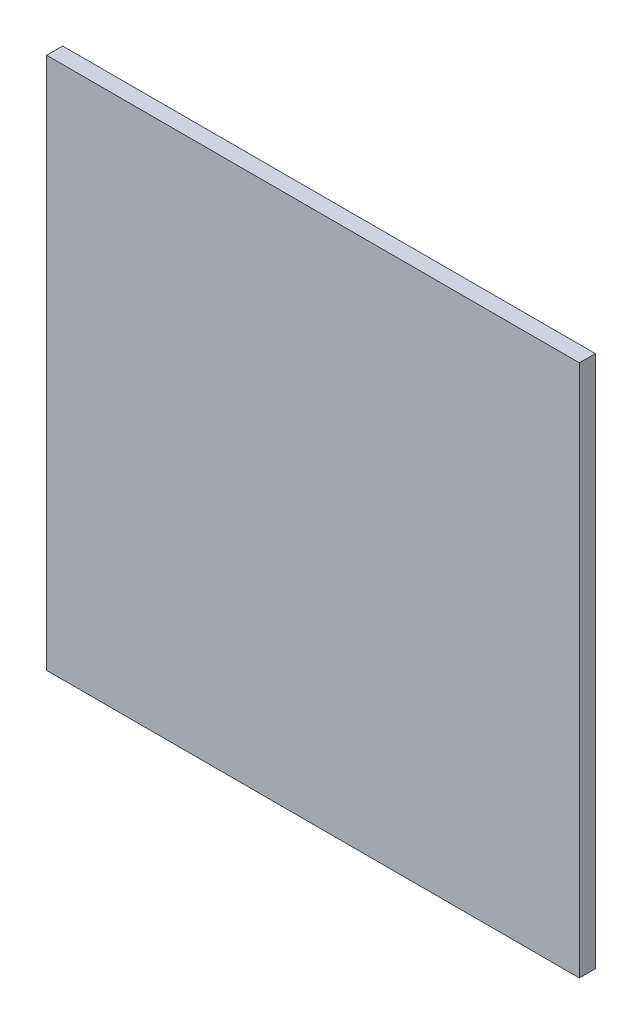
ISO-10303-21;
HEADER;
FILE_DESCRIPTION(('STEP AP214'),'2;1');
FILE_NAME('part.step','',(''),(''),'','','');
FILE_SCHEMA(('AUTOMOTIVE_DESIGN { 1 0 10303 214 1 1 1 1 }'));
ENDSEC;
DATA;
#1=APPLICATION_CONTEXT('core data for automotive mechanical design processes');
#2=APPLICATION_PROTOCOL_DEFINITION('international standard','automotive_design',2000,#1);
#3=PRODUCT_CONTEXT('',#1,'mechanical');
#4=PRODUCT('Part','Part','',(#3));
#5=PRODUCT_RELATED_PRODUCT_CATEGORY('part','',(#4));
#6=PRODUCT_DEFINITION_FORMATION('','',#4);
#7=PRODUCT_DEFINITION_CONTEXT('part definition',#1,'design');
#8=PRODUCT_DEFINITION('design','',#6,#7);
#9=PRODUCT_DEFINITION_SHAPE('','',#8);
#10=(LENGTH_UNIT() NAMED_UNIT(*) SI_UNIT(.MILLI.,.METRE.));
#11=(NAMED_UNIT(*) PLANE_ANGLE_UNIT() SI_UNIT($,.RADIAN.));
#12=(NAMED_UNIT(*) SI_UNIT($,.STERADIAN.) SOLID_ANGLE_UNIT());
#13=UNCERTAINTY_MEASURE_WITH_UNIT(LENGTH_MEASURE(1.E-05),#10,'distance_accuracy_value','');
#14=(GEOMETRIC_REPRESENTATION_CONTEXT(3) GLOBAL_UNCERTAINTY_ASSIGNED_CONTEXT((#13)) GLOBAL_UNIT_ASSIGNED_CONTEXT((#10,
#11,#12)) REPRESENTATION_CONTEXT('',''));
#15=CARTESIAN_POINT('',(0.,0.,0.));
#16=DIRECTION('',(0.,0.,1.));
#17=DIRECTION('',(1.,0.,0.));
#18=AXIS2_PLACEMENT_3D('',#15,#16,#17);
#19=CARTESIAN_POINT('',(0.,0.,3.));
#20=DIRECTION('',(1.,0.,0.));
#21=DIRECTION('',(0.,0.,-1.));
#22=AXIS2_PLACEMENT_3D('',#19,#20,#21);
#23=PLANE('',#22);
#24=DIRECTION('',(0.,-1.,0.));
#25=VECTOR('',#24,1.);
#26=CARTESIAN_POINT('',(0.,0.,0.));
#27=LINE('',#26,#25);
#28=CARTESIAN_POINT('',(0.,100.,0.));
#29=VERTEX_POINT('',#28);
#30=CARTESIAN_POINT('',(0.,0.,0.));
#31=VERTEX_POINT('',#30);
#32=EDGE_CURVE('E107',#29,#31,#27,.T.);
#33=ORIENTED_EDGE('',*,*,#32,.T.);
#34=DIRECTION('',(0.,0.,-1.));
#35=VECTOR('',#34,1.);
#36=CARTESIAN_POINT('',(0.,0.,3.));
#37=LINE('',#36,#35);
#38=CARTESIAN_POINT('',(0.,0.,3.));
#39=VERTEX_POINT('',#38);
#40=EDGE_CURVE('E11',#39,#31,#37,.T.);
#41=ORIENTED_EDGE('',*,*,#40,.F.);
#42=DIRECTION('',(0.,-1.,0.));
#43=VECTOR('',#42,1.);
#44=CARTESIAN_POINT('',(0.,0.,3.));
#45=LINE('',#44,#43);
#46=CARTESIAN_POINT('',(0.,100.,3.));
#47=VERTEX_POINT('',#46);
#48=EDGE_CURVE('E91',#47,#39,#45,.T.);
#49=ORIENTED_EDGE('',*,*,#48,.F.);
#50=DIRECTION('',(0.,0.,-1.));
#51=VECTOR('',#50,1.);
#52=CARTESIAN_POINT('',(0.,100.,3.));
#53=LINE('',#52,#51);
#54=EDGE_CURVE('E103',#47,#29,#53,.T.);
#55=ORIENTED_EDGE('',*,*,#54,.T.);
#56=EDGE_LOOP('',(#33,#41,#49,#55));
#57=FACE_BOUND('',#56,.T.);
#58=ADVANCED_FACE('F39',(#57),#23,.F.);
#59=CARTESIAN_POINT('',(0.,0.,3.));
#60=DIRECTION('',(0.,1.,0.));
#61=DIRECTION('',(0.,0.,1.));
#62=AXIS2_PLACEMENT_3D('',#59,#60,#61);
#63=PLANE('',#62);
#64=DIRECTION('',(1.,0.,0.));
#65=VECTOR('',#64,1.);
#66=CARTESIAN_POINT('',(0.,0.,0.));
#67=LINE('',#66,#65);
#68=CARTESIAN_POINT('',(100.,0.,0.));
#69=VERTEX_POINT('',#68);
#70=EDGE_CURVE('E96',#31,#69,#67,.T.);
#71=ORIENTED_EDGE('',*,*,#70,.T.);
#72=DIRECTION('',(0.,0.,-1.));
#73=VECTOR('',#72,1.);
#74=CARTESIAN_POINT('',(100.,0.,3.));
#75=LINE('',#74,#73);
#76=CARTESIAN_POINT('',(100.,0.,3.));
#77=VERTEX_POINT('',#76);
#78=EDGE_CURVE('E48',#77,#69,#75,.T.);
#79=ORIENTED_EDGE('',*,*,#78,.F.);
#80=DIRECTION('',(1.,0.,0.));
#81=VECTOR('',#80,1.);
#82=CARTESIAN_POINT('',(0.,0.,3.));
#83=LINE('',#82,#81);
#84=EDGE_CURVE('E86',#39,#77,#83,.T.);
#85=ORIENTED_EDGE('',*,*,#84,.F.);
#86=ORIENTED_EDGE('',*,*,#40,.T.);
#87=EDGE_LOOP('',(#71,#79,#85,#86));
#88=FACE_BOUND('',#87,.T.);
#89=ADVANCED_FACE('F95',(#88),#63,.F.);
#90=CARTESIAN_POINT('',(100.,0.,3.));
#91=DIRECTION('',(-1.,0.,0.));
#92=DIRECTION('',(0.,0.,1.));
#93=AXIS2_PLACEMENT_3D('',#90,#91,#92);
#94=PLANE('',#93);
#95=DIRECTION('',(0.,1.,0.));
#96=VECTOR('',#95,1.);
#97=CARTESIAN_POINT('',(100.,0.,0.));
#98=LINE('',#97,#96);
#99=CARTESIAN_POINT('',(100.,100.,0.));
#100=VERTEX_POINT('',#99);
#101=EDGE_CURVE('E73',#69,#100,#98,.T.);
#102=ORIENTED_EDGE('',*,*,#101,.T.);
#103=DIRECTION('',(0.,0.,-1.));
#104=VECTOR('',#103,1.);
#105=CARTESIAN_POINT('',(100.,100.,3.));
#106=LINE('',#105,#104);
#107=CARTESIAN_POINT('',(100.,100.,3.));
#108=VERTEX_POINT('',#107);
#109=EDGE_CURVE('E98',#108,#100,#106,.T.);
#110=ORIENTED_EDGE('',*,*,#109,.F.);
#111=DIRECTION('',(0.,1.,0.));
#112=VECTOR('',#111,1.);
#113=CARTESIAN_POINT('',(100.,0.,3.));
#114=LINE('',#113,#112);
#115=EDGE_CURVE('E89',#77,#108,#114,.T.);
#116=ORIENTED_EDGE('',*,*,#115,.F.);
#117=ORIENTED_EDGE('',*,*,#78,.T.);
#118=EDGE_LOOP('',(#102,#110,#116,#117));
#119=FACE_BOUND('',#118,.T.);
#120=ADVANCED_FACE('F99',(#119),#94,.F.);
#121=CARTESIAN_POINT('',(0.,100.,3.));
#122=DIRECTION('',(0.,-1.,0.));
#123=DIRECTION('',(0.,0.,-1.));
#124=AXIS2_PLACEMENT_3D('',#121,#122,#123);
#125=PLANE('',#124);
#126=DIRECTION('',(-1.,0.,0.));
#127=VECTOR('',#126,1.);
#128=CARTESIAN_POINT('',(0.,100.,0.));
#129=LINE('',#128,#127);
#130=EDGE_CURVE('E79',#100,#29,#129,.T.);
#131=ORIENTED_EDGE('',*,*,#130,.T.);
#132=ORIENTED_EDGE('',*,*,#54,.F.);
#133=DIRECTION('',(-1.,0.,0.));
#134=VECTOR('',#133,1.);
#135=CARTESIAN_POINT('',(0.,100.,3.));
#136=LINE('',#135,#134);
#137=EDGE_CURVE('E56',#108,#47,#136,.T.);
#138=ORIENTED_EDGE('',*,*,#137,.F.);
#139=ORIENTED_EDGE('',*,*,#109,.T.);
#140=EDGE_LOOP('',(#131,#132,#138,#139));
#141=FACE_BOUND('',#140,.T.);
#142=ADVANCED_FACE('F120',(#141),#125,.F.);
#143=CARTESIAN_POINT('',(0.,0.,3.));
#144=DIRECTION('',(0.,0.,-1.));
#145=DIRECTION('',(-1.,0.,0.));
#146=AXIS2_PLACEMENT_3D('',#143,#144,#145);
#147=PLANE('',#146);
#148=ORIENTED_EDGE('',*,*,#48,.T.);
#149=ORIENTED_EDGE('',*,*,#84,.T.);
#150=ORIENTED_EDGE('',*,*,#115,.T.);
#151=ORIENTED_EDGE('',*,*,#137,.T.);
#152=EDGE_LOOP('',(#148,#149,#150,#151));
#153=FACE_BOUND('',#152,.T.);
#154=ADVANCED_FACE('F87',(#153),#147,.F.);
#155=CARTESIAN_POINT('',(0.,0.,0.));
#156=DIRECTION('',(0.,0.,-1.));
#157=DIRECTION('',(-1.,0.,0.));
#158=AXIS2_PLACEMENT_3D('',#155,#156,#157);
#159=PLANE('',#158);
#160=ORIENTED_EDGE('',*,*,#32,.F.);
#161=ORIENTED_EDGE('',*,*,#130,.F.);
#162=ORIENTED_EDGE('',*,*,#101,.F.);
#163=ORIENTED_EDGE('',*,*,#70,.F.);
#164=EDGE_LOOP('',(#160,#161,#162,#163));
#165=FACE_BOUND('',#164,.T.);
#166=ADVANCED_FACE('F123',(#165),#159,.T.);
#167=CLOSED_SHELL('',(#58,#89,#120,#142,#154,#166));
#168=MANIFOLD_SOLID_BREP('B2',#167);
#169=ADVANCED_BREP_SHAPE_REPRESENTATION('',(#18,#168),#14);
#170=SHAPE_DEFINITION_REPRESENTATION(#9,#169);
ENDSEC;
END-ISO-10303-21;
